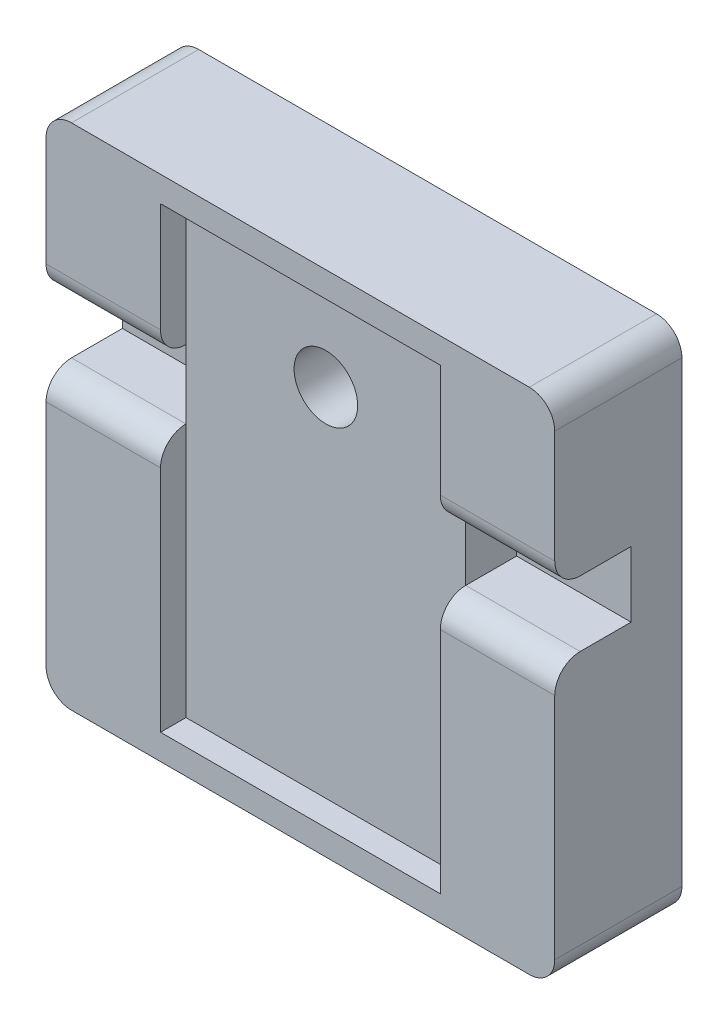
ISO-10303-21;
HEADER;
FILE_DESCRIPTION(('STEP AP214'),'2;1');
FILE_NAME('part.step','',(''),(''),'','','');
FILE_SCHEMA(('AUTOMOTIVE_DESIGN { 1 0 10303 214 1 1 1 1 }'));
ENDSEC;
DATA;
#1=APPLICATION_CONTEXT('core data for automotive mechanical design processes');
#2=APPLICATION_PROTOCOL_DEFINITION('international standard','automotive_design',2000,#1);
#3=PRODUCT_CONTEXT('',#1,'mechanical');
#4=PRODUCT('Part','Part','',(#3));
#5=PRODUCT_RELATED_PRODUCT_CATEGORY('part','',(#4));
#6=PRODUCT_DEFINITION_FORMATION('','',#4);
#7=PRODUCT_DEFINITION_CONTEXT('part definition',#1,'design');
#8=PRODUCT_DEFINITION('design','',#6,#7);
#9=PRODUCT_DEFINITION_SHAPE('','',#8);
#10=(LENGTH_UNIT() NAMED_UNIT(*) SI_UNIT(.MILLI.,.METRE.));
#11=(NAMED_UNIT(*) PLANE_ANGLE_UNIT() SI_UNIT($,.RADIAN.));
#12=(NAMED_UNIT(*) SI_UNIT($,.STERADIAN.) SOLID_ANGLE_UNIT());
#13=UNCERTAINTY_MEASURE_WITH_UNIT(LENGTH_MEASURE(1.E-05),#10,'distance_accuracy_value','');
#14=(GEOMETRIC_REPRESENTATION_CONTEXT(3) GLOBAL_UNCERTAINTY_ASSIGNED_CONTEXT((#13)) GLOBAL_UNIT_ASSIGNED_CONTEXT((#10,
#11,#12)) REPRESENTATION_CONTEXT('',''));
#15=CARTESIAN_POINT('',(0.,0.,0.));
#16=DIRECTION('',(0.,0.,1.));
#17=DIRECTION('',(1.,0.,0.));
#18=AXIS2_PLACEMENT_3D('',#15,#16,#17);
#19=CARTESIAN_POINT('',(0.,0.,5.));
#20=DIRECTION('',(0.,0.,1.));
#21=DIRECTION('',(1.,0.,0.));
#22=AXIS2_PLACEMENT_3D('',#19,#20,#21);
#23=PLANE('',#22);
#24=DIRECTION('',(0.,1.,0.));
#25=VECTOR('',#24,1.);
#26=CARTESIAN_POINT('',(5.5,9.,5.));
#27=LINE('',#26,#25);
#28=CARTESIAN_POINT('',(5.5,4.57485358255454,5.));
#29=VERTEX_POINT('',#28);
#30=CARTESIAN_POINT('',(5.5,9.,5.));
#31=VERTEX_POINT('',#30);
#32=EDGE_CURVE('E258',#29,#31,#27,.T.);
#33=ORIENTED_EDGE('',*,*,#32,.F.);
#34=DIRECTION('',(-1.,0.,0.));
#35=VECTOR('',#34,1.);
#36=CARTESIAN_POINT('',(10.,4.57485358255454,5.));
#37=LINE('',#36,#35);
#38=CARTESIAN_POINT('',(10.,4.57485358255454,5.));
#39=VERTEX_POINT('',#38);
#40=EDGE_CURVE('E356',#29,#39,#37,.F.);
#41=ORIENTED_EDGE('',*,*,#40,.T.);
#42=DIRECTION('',(0.,1.,0.));
#43=VECTOR('',#42,1.);
#44=CARTESIAN_POINT('',(10.,10.,5.));
#45=LINE('',#44,#43);
#46=CARTESIAN_POINT('',(10.,9.,5.));
#47=VERTEX_POINT('',#46);
#48=EDGE_CURVE('E303',#39,#47,#45,.T.);
#49=ORIENTED_EDGE('',*,*,#48,.T.);
#50=CARTESIAN_POINT('',(9.,9.,5.));
#51=DIRECTION('',(0.,0.,1.));
#52=DIRECTION('',(1.,0.,0.));
#53=AXIS2_PLACEMENT_3D('',#50,#51,#52);
#54=CIRCLE('',#53,1.);
#55=CARTESIAN_POINT('',(9.,10.,5.));
#56=VERTEX_POINT('',#55);
#57=EDGE_CURVE('E352',#47,#56,#54,.T.);
#58=ORIENTED_EDGE('',*,*,#57,.T.);
#59=DIRECTION('',(-1.,0.,0.));
#60=VECTOR('',#59,1.);
#61=CARTESIAN_POINT('',(-10.,10.,5.));
#62=LINE('',#61,#60);
#63=CARTESIAN_POINT('',(-9.,10.,5.));
#64=VERTEX_POINT('',#63);
#65=EDGE_CURVE('E302',#56,#64,#62,.T.);
#66=ORIENTED_EDGE('',*,*,#65,.T.);
#67=CARTESIAN_POINT('',(-9.,9.,5.));
#68=DIRECTION('',(0.,0.,1.));
#69=DIRECTION('',(1.,0.,0.));
#70=AXIS2_PLACEMENT_3D('',#67,#68,#69);
#71=CIRCLE('',#70,1.);
#72=CARTESIAN_POINT('',(-10.,9.,5.));
#73=VERTEX_POINT('',#72);
#74=EDGE_CURVE('E350',#64,#73,#71,.T.);
#75=ORIENTED_EDGE('',*,*,#74,.T.);
#76=DIRECTION('',(0.,-1.,0.));
#77=VECTOR('',#76,1.);
#78=CARTESIAN_POINT('',(-10.,10.,5.));
#79=LINE('',#78,#77);
#80=CARTESIAN_POINT('',(-10.,4.7,5.));
#81=VERTEX_POINT('',#80);
#82=EDGE_CURVE('E307',#73,#81,#79,.T.);
#83=ORIENTED_EDGE('',*,*,#82,.T.);
#84=DIRECTION('',(-1.,0.,0.));
#85=VECTOR('',#84,1.);
#86=CARTESIAN_POINT('',(-5.5,4.7,5.));
#87=LINE('',#86,#85);
#88=CARTESIAN_POINT('',(-5.5,4.7,5.));
#89=VERTEX_POINT('',#88);
#90=EDGE_CURVE('E354',#81,#89,#87,.F.);
#91=ORIENTED_EDGE('',*,*,#90,.T.);
#92=DIRECTION('',(0.,-1.,0.));
#93=VECTOR('',#92,1.);
#94=CARTESIAN_POINT('',(-5.5,9.,5.));
#95=LINE('',#94,#93);
#96=CARTESIAN_POINT('',(-5.5,9.,5.));
#97=VERTEX_POINT('',#96);
#98=EDGE_CURVE('E283',#97,#89,#95,.T.);
#99=ORIENTED_EDGE('',*,*,#98,.F.);
#100=DIRECTION('',(-1.,0.,0.));
#101=VECTOR('',#100,1.);
#102=CARTESIAN_POINT('',(-5.5,9.,5.));
#103=LINE('',#102,#101);
#104=EDGE_CURVE('E279',#31,#97,#103,.T.);
#105=ORIENTED_EDGE('',*,*,#104,.F.);
#106=EDGE_LOOP('',(#33,#41,#49,#58,#66,#75,#83,#91,#99,#105));
#107=FACE_BOUND('',#106,.T.);
#108=ADVANCED_FACE('F33',(#107),#23,.T.);
#109=CARTESIAN_POINT('',(5.5,9.,4.));
#110=DIRECTION('',(1.,0.,0.));
#111=DIRECTION('',(0.,1.,0.));
#112=AXIS2_PLACEMENT_3D('',#109,#110,#111);
#113=PLANE('',#112);
#114=DIRECTION('',(0.,1.,0.));
#115=VECTOR('',#114,1.);
#116=CARTESIAN_POINT('',(5.5,9.,4.));
#117=LINE('',#116,#115);
#118=CARTESIAN_POINT('',(5.5,3.57485358255454,4.));
#119=VERTEX_POINT('',#118);
#120=CARTESIAN_POINT('',(5.5,9.,4.));
#121=VERTEX_POINT('',#120);
#122=EDGE_CURVE('E264',#119,#121,#117,.T.);
#123=ORIENTED_EDGE('',*,*,#122,.F.);
#124=CARTESIAN_POINT('',(5.5,4.57485358255454,4.));
#125=DIRECTION('',(1.,0.,0.));
#126=DIRECTION('',(0.,1.,0.));
#127=AXIS2_PLACEMENT_3D('',#124,#125,#126);
#128=CIRCLE('',#127,1.);
#129=EDGE_CURVE('E348',#119,#29,#128,.F.);
#130=ORIENTED_EDGE('',*,*,#129,.T.);
#131=ORIENTED_EDGE('',*,*,#32,.T.);
#132=DIRECTION('',(0.,0.,1.));
#133=VECTOR('',#132,1.);
#134=CARTESIAN_POINT('',(5.5,9.,4.));
#135=LINE('',#134,#133);
#136=EDGE_CURVE('E275',#121,#31,#135,.T.);
#137=ORIENTED_EDGE('',*,*,#136,.F.);
#138=EDGE_LOOP('',(#123,#130,#131,#137));
#139=FACE_BOUND('',#138,.T.);
#140=ADVANCED_FACE('F499',(#139),#113,.F.);
#141=CARTESIAN_POINT('',(-5.5,9.,4.));
#142=DIRECTION('',(-1.,0.,0.));
#143=DIRECTION('',(0.,-1.,0.));
#144=AXIS2_PLACEMENT_3D('',#141,#142,#143);
#145=PLANE('',#144);
#146=ORIENTED_EDGE('',*,*,#98,.T.);
#147=CARTESIAN_POINT('',(-5.5,4.7,4.));
#148=DIRECTION('',(-1.,0.,0.));
#149=DIRECTION('',(0.,-1.,0.));
#150=AXIS2_PLACEMENT_3D('',#147,#148,#149);
#151=CIRCLE('',#150,1.);
#152=CARTESIAN_POINT('',(-5.5,3.7,4.));
#153=VERTEX_POINT('',#152);
#154=EDGE_CURVE('E373',#89,#153,#151,.F.);
#155=ORIENTED_EDGE('',*,*,#154,.T.);
#156=DIRECTION('',(0.,-1.,0.));
#157=VECTOR('',#156,1.);
#158=CARTESIAN_POINT('',(-5.5,9.,4.));
#159=LINE('',#158,#157);
#160=CARTESIAN_POINT('',(-5.5,9.,4.));
#161=VERTEX_POINT('',#160);
#162=EDGE_CURVE('E268',#161,#153,#159,.T.);
#163=ORIENTED_EDGE('',*,*,#162,.F.);
#164=DIRECTION('',(0.,0.,1.));
#165=VECTOR('',#164,1.);
#166=CARTESIAN_POINT('',(-5.5,9.,4.));
#167=LINE('',#166,#165);
#168=EDGE_CURVE('E295',#161,#97,#167,.T.);
#169=ORIENTED_EDGE('',*,*,#168,.T.);
#170=EDGE_LOOP('',(#146,#155,#163,#169));
#171=FACE_BOUND('',#170,.T.);
#172=ADVANCED_FACE('F470',(#171),#145,.F.);
#173=CARTESIAN_POINT('',(10.,10.,5.));
#174=DIRECTION('',(-1.,0.,0.));
#175=DIRECTION('',(0.,-1.,0.));
#176=AXIS2_PLACEMENT_3D('',#173,#174,#175);
#177=PLANE('',#176);
#178=DIRECTION('',(0.,0.,1.));
#179=VECTOR('',#178,1.);
#180=CARTESIAN_POINT('',(10.,1.,2.));
#181=LINE('',#180,#179);
#182=CARTESIAN_POINT('',(10.,1.,2.));
#183=VERTEX_POINT('',#182);
#184=CARTESIAN_POINT('',(10.,1.,4.));
#185=VERTEX_POINT('',#184);
#186=EDGE_CURVE('E246',#183,#185,#181,.T.);
#187=ORIENTED_EDGE('',*,*,#186,.T.);
#188=CARTESIAN_POINT('',(10.,0.,4.));
#189=DIRECTION('',(-1.,0.,0.));
#190=DIRECTION('',(0.,-1.,0.));
#191=AXIS2_PLACEMENT_3D('',#188,#189,#190);
#192=CIRCLE('',#191,1.);
#193=CARTESIAN_POINT('',(10.,0.,5.));
#194=VERTEX_POINT('',#193);
#195=EDGE_CURVE('E333',#185,#194,#192,.F.);
#196=ORIENTED_EDGE('',*,*,#195,.T.);
#197=CARTESIAN_POINT('',(10.,-9.,5.));
#198=VERTEX_POINT('',#197);
#199=EDGE_CURVE('E299',#198,#194,#45,.T.);
#200=ORIENTED_EDGE('',*,*,#199,.F.);
#201=DIRECTION('',(0.,0.,-1.));
#202=VECTOR('',#201,1.);
#203=CARTESIAN_POINT('',(10.,-9.,5.));
#204=LINE('',#203,#202);
#205=CARTESIAN_POINT('',(10.,-9.,0.));
#206=VERTEX_POINT('',#205);
#207=EDGE_CURVE('E328',#198,#206,#204,.T.);
#208=ORIENTED_EDGE('',*,*,#207,.T.);
#209=DIRECTION('',(0.,1.,0.));
#210=VECTOR('',#209,1.);
#211=CARTESIAN_POINT('',(10.,10.,0.));
#212=LINE('',#211,#210);
#213=CARTESIAN_POINT('',(10.,9.,0.));
#214=VERTEX_POINT('',#213);
#215=EDGE_CURVE('E291',#206,#214,#212,.T.);
#216=ORIENTED_EDGE('',*,*,#215,.T.);
#217=DIRECTION('',(0.,0.,-1.));
#218=VECTOR('',#217,1.);
#219=CARTESIAN_POINT('',(10.,9.,5.));
#220=LINE('',#219,#218);
#221=EDGE_CURVE('E326',#214,#47,#220,.F.);
#222=ORIENTED_EDGE('',*,*,#221,.T.);
#223=ORIENTED_EDGE('',*,*,#48,.F.);
#224=CARTESIAN_POINT('',(10.,4.57485358255454,4.));
#225=DIRECTION('',(-1.,0.,0.));
#226=DIRECTION('',(0.,-1.,0.));
#227=AXIS2_PLACEMENT_3D('',#224,#225,#226);
#228=CIRCLE('',#227,1.);
#229=CARTESIAN_POINT('',(10.,3.57485358255454,4.));
#230=VERTEX_POINT('',#229);
#231=EDGE_CURVE('E331',#39,#230,#228,.F.);
#232=ORIENTED_EDGE('',*,*,#231,.T.);
#233=DIRECTION('',(0.,0.,1.));
#234=VECTOR('',#233,1.);
#235=CARTESIAN_POINT('',(10.,3.57485358255454,2.));
#236=LINE('',#235,#234);
#237=CARTESIAN_POINT('',(10.,3.57485358255454,2.));
#238=VERTEX_POINT('',#237);
#239=EDGE_CURVE('E243',#238,#230,#236,.T.);
#240=ORIENTED_EDGE('',*,*,#239,.F.);
#241=DIRECTION('',(0.,1.,0.));
#242=VECTOR('',#241,1.);
#243=CARTESIAN_POINT('',(10.,1.,2.));
#244=LINE('',#243,#242);
#245=EDGE_CURVE('E235',#183,#238,#244,.T.);
#246=ORIENTED_EDGE('',*,*,#245,.F.);
#247=EDGE_LOOP('',(#187,#196,#200,#208,#216,#222,#223,#232,#240,#246));
#248=FACE_BOUND('',#247,.T.);
#249=ADVANCED_FACE('F418',(#248),#177,.F.);
#250=CARTESIAN_POINT('',(-10.,10.,5.));
#251=DIRECTION('',(0.,-1.,0.));
#252=DIRECTION('',(0.,0.,-1.));
#253=AXIS2_PLACEMENT_3D('',#250,#251,#252);
#254=PLANE('',#253);
#255=ORIENTED_EDGE('',*,*,#65,.F.);
#256=DIRECTION('',(0.,0.,-1.));
#257=VECTOR('',#256,1.);
#258=CARTESIAN_POINT('',(9.,10.,5.));
#259=LINE('',#258,#257);
#260=CARTESIAN_POINT('',(9.,10.,0.));
#261=VERTEX_POINT('',#260);
#262=EDGE_CURVE('E11',#56,#261,#259,.T.);
#263=ORIENTED_EDGE('',*,*,#262,.T.);
#264=DIRECTION('',(-1.,0.,0.));
#265=VECTOR('',#264,1.);
#266=CARTESIAN_POINT('',(-10.,10.,0.));
#267=LINE('',#266,#265);
#268=CARTESIAN_POINT('',(-9.,10.,0.));
#269=VERTEX_POINT('',#268);
#270=EDGE_CURVE('E316',#261,#269,#267,.T.);
#271=ORIENTED_EDGE('',*,*,#270,.T.);
#272=DIRECTION('',(0.,0.,-1.));
#273=VECTOR('',#272,1.);
#274=CARTESIAN_POINT('',(-9.,10.,5.));
#275=LINE('',#274,#273);
#276=EDGE_CURVE('E41',#269,#64,#275,.F.);
#277=ORIENTED_EDGE('',*,*,#276,.T.);
#278=EDGE_LOOP('',(#255,#263,#271,#277));
#279=FACE_BOUND('',#278,.T.);
#280=ADVANCED_FACE('F388',(#279),#254,.F.);
#281=CARTESIAN_POINT('',(-10.,10.,5.));
#282=DIRECTION('',(1.,0.,0.));
#283=DIRECTION('',(0.,1.,0.));
#284=AXIS2_PLACEMENT_3D('',#281,#282,#283);
#285=PLANE('',#284);
#286=CARTESIAN_POINT('',(-10.,0.,5.));
#287=VERTEX_POINT('',#286);
#288=CARTESIAN_POINT('',(-10.,-9.,5.));
#289=VERTEX_POINT('',#288);
#290=EDGE_CURVE('E306',#287,#289,#79,.T.);
#291=ORIENTED_EDGE('',*,*,#290,.F.);
#292=CARTESIAN_POINT('',(-10.,0.,4.));
#293=DIRECTION('',(1.,0.,0.));
#294=DIRECTION('',(0.,1.,0.));
#295=AXIS2_PLACEMENT_3D('',#292,#293,#294);
#296=CIRCLE('',#295,1.);
#297=CARTESIAN_POINT('',(-10.,1.,4.));
#298=VERTEX_POINT('',#297);
#299=EDGE_CURVE('E222',#287,#298,#296,.F.);
#300=ORIENTED_EDGE('',*,*,#299,.T.);
#301=DIRECTION('',(0.,0.,1.));
#302=VECTOR('',#301,1.);
#303=CARTESIAN_POINT('',(-10.,1.,2.));
#304=LINE('',#303,#302);
#305=CARTESIAN_POINT('',(-10.,1.,2.));
#306=VERTEX_POINT('',#305);
#307=EDGE_CURVE('E200',#306,#298,#304,.T.);
#308=ORIENTED_EDGE('',*,*,#307,.F.);
#309=DIRECTION('',(0.,-1.,0.));
#310=VECTOR('',#309,1.);
#311=CARTESIAN_POINT('',(-10.,3.7,2.));
#312=LINE('',#311,#310);
#313=CARTESIAN_POINT('',(-10.,3.7,2.));
#314=VERTEX_POINT('',#313);
#315=EDGE_CURVE('E208',#314,#306,#312,.T.);
#316=ORIENTED_EDGE('',*,*,#315,.F.);
#317=DIRECTION('',(0.,0.,1.));
#318=VECTOR('',#317,1.);
#319=CARTESIAN_POINT('',(-10.,3.7,2.));
#320=LINE('',#319,#318);
#321=CARTESIAN_POINT('',(-10.,3.7,4.));
#322=VERTEX_POINT('',#321);
#323=EDGE_CURVE('E255',#314,#322,#320,.T.);
#324=ORIENTED_EDGE('',*,*,#323,.T.);
#325=CARTESIAN_POINT('',(-10.,4.7,4.));
#326=DIRECTION('',(1.,0.,0.));
#327=DIRECTION('',(0.,1.,0.));
#328=AXIS2_PLACEMENT_3D('',#325,#326,#327);
#329=CIRCLE('',#328,1.);
#330=EDGE_CURVE('E367',#322,#81,#329,.F.);
#331=ORIENTED_EDGE('',*,*,#330,.T.);
#332=ORIENTED_EDGE('',*,*,#82,.F.);
#333=DIRECTION('',(0.,0.,-1.));
#334=VECTOR('',#333,1.);
#335=CARTESIAN_POINT('',(-10.,9.,5.));
#336=LINE('',#335,#334);
#337=CARTESIAN_POINT('',(-10.,9.,0.));
#338=VERTEX_POINT('',#337);
#339=EDGE_CURVE('E362',#73,#338,#336,.T.);
#340=ORIENTED_EDGE('',*,*,#339,.T.);
#341=DIRECTION('',(0.,-1.,0.));
#342=VECTOR('',#341,1.);
#343=CARTESIAN_POINT('',(-10.,10.,0.));
#344=LINE('',#343,#342);
#345=CARTESIAN_POINT('',(-10.,-9.,0.));
#346=VERTEX_POINT('',#345);
#347=EDGE_CURVE('E318',#338,#346,#344,.T.);
#348=ORIENTED_EDGE('',*,*,#347,.T.);
#349=DIRECTION('',(0.,0.,-1.));
#350=VECTOR('',#349,1.);
#351=CARTESIAN_POINT('',(-10.,-9.,5.));
#352=LINE('',#351,#350);
#353=EDGE_CURVE('E365',#346,#289,#352,.F.);
#354=ORIENTED_EDGE('',*,*,#353,.T.);
#355=EDGE_LOOP('',(#291,#300,#308,#316,#324,#331,#332,#340,#348,#354));
#356=FACE_BOUND('',#355,.T.);
#357=ADVANCED_FACE('F220',(#356),#285,.F.);
#358=CARTESIAN_POINT('',(-10.,-10.,5.));
#359=DIRECTION('',(0.,1.,0.));
#360=DIRECTION('',(0.,0.,1.));
#361=AXIS2_PLACEMENT_3D('',#358,#359,#360);
#362=PLANE('',#361);
#363=DIRECTION('',(1.,0.,0.));
#364=VECTOR('',#363,1.);
#365=CARTESIAN_POINT('',(-10.,-10.,5.));
#366=LINE('',#365,#364);
#367=CARTESIAN_POINT('',(-9.,-10.,5.));
#368=VERTEX_POINT('',#367);
#369=CARTESIAN_POINT('',(9.,-10.,5.));
#370=VERTEX_POINT('',#369);
#371=EDGE_CURVE('E310',#368,#370,#366,.T.);
#372=ORIENTED_EDGE('',*,*,#371,.F.);
#373=DIRECTION('',(0.,0.,-1.));
#374=VECTOR('',#373,1.);
#375=CARTESIAN_POINT('',(-9.,-10.,5.));
#376=LINE('',#375,#374);
#377=CARTESIAN_POINT('',(-9.,-10.,0.));
#378=VERTEX_POINT('',#377);
#379=EDGE_CURVE('E377',#368,#378,#376,.T.);
#380=ORIENTED_EDGE('',*,*,#379,.T.);
#381=DIRECTION('',(1.,0.,0.));
#382=VECTOR('',#381,1.);
#383=CARTESIAN_POINT('',(-10.,-10.,0.));
#384=LINE('',#383,#382);
#385=CARTESIAN_POINT('',(9.,-10.,0.));
#386=VERTEX_POINT('',#385);
#387=EDGE_CURVE('E321',#378,#386,#384,.T.);
#388=ORIENTED_EDGE('',*,*,#387,.T.);
#389=DIRECTION('',(0.,0.,-1.));
#390=VECTOR('',#389,1.);
#391=CARTESIAN_POINT('',(9.,-10.,5.));
#392=LINE('',#391,#390);
#393=EDGE_CURVE('E375',#386,#370,#392,.F.);
#394=ORIENTED_EDGE('',*,*,#393,.T.);
#395=EDGE_LOOP('',(#372,#380,#388,#394));
#396=FACE_BOUND('',#395,.T.);
#397=ADVANCED_FACE('F406',(#396),#362,.F.);
#398=ORIENTED_EDGE('',*,*,#199,.T.);
#399=DIRECTION('',(1.,0.,0.));
#400=VECTOR('',#399,1.);
#401=CARTESIAN_POINT('',(5.5,0.,5.));
#402=LINE('',#401,#400);
#403=CARTESIAN_POINT('',(5.5,0.,5.));
#404=VERTEX_POINT('',#403);
#405=EDGE_CURVE('E341',#194,#404,#402,.F.);
#406=ORIENTED_EDGE('',*,*,#405,.T.);
#407=CARTESIAN_POINT('',(5.5,-9.,5.));
#408=VERTEX_POINT('',#407);
#409=EDGE_CURVE('E276',#408,#404,#27,.T.);
#410=ORIENTED_EDGE('',*,*,#409,.F.);
#411=DIRECTION('',(1.,0.,0.));
#412=VECTOR('',#411,1.);
#413=CARTESIAN_POINT('',(-5.5,-9.,5.));
#414=LINE('',#413,#412);
#415=CARTESIAN_POINT('',(-5.5,-9.,5.));
#416=VERTEX_POINT('',#415);
#417=EDGE_CURVE('E286',#416,#408,#414,.T.);
#418=ORIENTED_EDGE('',*,*,#417,.F.);
#419=CARTESIAN_POINT('',(-5.5,0.,5.));
#420=VERTEX_POINT('',#419);
#421=EDGE_CURVE('E282',#420,#416,#95,.T.);
#422=ORIENTED_EDGE('',*,*,#421,.F.);
#423=DIRECTION('',(1.,0.,0.));
#424=VECTOR('',#423,1.);
#425=CARTESIAN_POINT('',(-10.,0.,5.));
#426=LINE('',#425,#424);
#427=EDGE_CURVE('E339',#420,#287,#426,.F.);
#428=ORIENTED_EDGE('',*,*,#427,.T.);
#429=ORIENTED_EDGE('',*,*,#290,.T.);
#430=CARTESIAN_POINT('',(-9.,-9.,5.));
#431=DIRECTION('',(0.,0.,1.));
#432=DIRECTION('',(1.,0.,0.));
#433=AXIS2_PLACEMENT_3D('',#430,#431,#432);
#434=CIRCLE('',#433,1.);
#435=EDGE_CURVE('E337',#289,#368,#434,.T.);
#436=ORIENTED_EDGE('',*,*,#435,.T.);
#437=ORIENTED_EDGE('',*,*,#371,.T.);
#438=CARTESIAN_POINT('',(9.,-9.,5.));
#439=DIRECTION('',(0.,0.,1.));
#440=DIRECTION('',(1.,0.,0.));
#441=AXIS2_PLACEMENT_3D('',#438,#439,#440);
#442=CIRCLE('',#441,1.);
#443=EDGE_CURVE('E335',#370,#198,#442,.T.);
#444=ORIENTED_EDGE('',*,*,#443,.T.);
#445=EDGE_LOOP('',(#398,#406,#410,#418,#422,#428,#429,#436,#437,#444));
#446=FACE_BOUND('',#445,.T.);
#447=ADVANCED_FACE('F410',(#446),#23,.T.);
#448=CARTESIAN_POINT('',(0.,0.,0.));
#449=DIRECTION('',(0.,0.,1.));
#450=DIRECTION('',(1.,0.,0.));
#451=AXIS2_PLACEMENT_3D('',#448,#449,#450);
#452=PLANE('',#451);
#453=CARTESIAN_POINT('',(0.,5.,0.));
#454=DIRECTION('',(0.,0.,1.));
#455=DIRECTION('',(1.,0.,0.));
#456=AXIS2_PLACEMENT_3D('',#453,#454,#455);
#457=CIRCLE('',#456,1.25);
#458=CARTESIAN_POINT('',(1.25,5.,0.));
#459=VERTEX_POINT('',#458);
#460=EDGE_CURVE('E251',#459,#459,#457,.T.);
#461=ORIENTED_EDGE('',*,*,#460,.T.);
#462=EDGE_LOOP('',(#461));
#463=FACE_BOUND('',#462,.T.);
#464=ORIENTED_EDGE('',*,*,#387,.F.);
#465=CARTESIAN_POINT('',(-9.,-9.,0.));
#466=DIRECTION('',(0.,0.,1.));
#467=DIRECTION('',(1.,0.,0.));
#468=AXIS2_PLACEMENT_3D('',#465,#466,#467);
#469=CIRCLE('',#468,1.);
#470=EDGE_CURVE('E384',#378,#346,#469,.F.);
#471=ORIENTED_EDGE('',*,*,#470,.T.);
#472=ORIENTED_EDGE('',*,*,#347,.F.);
#473=CARTESIAN_POINT('',(-9.,9.,0.));
#474=DIRECTION('',(0.,0.,1.));
#475=DIRECTION('',(1.,0.,0.));
#476=AXIS2_PLACEMENT_3D('',#473,#474,#475);
#477=CIRCLE('',#476,1.);
#478=EDGE_CURVE('E48',#338,#269,#477,.F.);
#479=ORIENTED_EDGE('',*,*,#478,.T.);
#480=ORIENTED_EDGE('',*,*,#270,.F.);
#481=CARTESIAN_POINT('',(9.,9.,0.));
#482=DIRECTION('',(0.,0.,1.));
#483=DIRECTION('',(1.,0.,0.));
#484=AXIS2_PLACEMENT_3D('',#481,#482,#483);
#485=CIRCLE('',#484,1.);
#486=EDGE_CURVE('E56',#261,#214,#485,.F.);
#487=ORIENTED_EDGE('',*,*,#486,.T.);
#488=ORIENTED_EDGE('',*,*,#215,.F.);
#489=CARTESIAN_POINT('',(9.,-9.,0.));
#490=DIRECTION('',(0.,0.,1.));
#491=DIRECTION('',(1.,0.,0.));
#492=AXIS2_PLACEMENT_3D('',#489,#490,#491);
#493=CIRCLE('',#492,1.);
#494=EDGE_CURVE('E382',#206,#386,#493,.F.);
#495=ORIENTED_EDGE('',*,*,#494,.T.);
#496=EDGE_LOOP('',(#464,#471,#472,#479,#480,#487,#488,#495));
#497=FACE_BOUND('',#496,.T.);
#498=ADVANCED_FACE('F399',(#463,#497),#452,.F.);
#499=ORIENTED_EDGE('',*,*,#409,.T.);
#500=CARTESIAN_POINT('',(5.5,0.,4.));
#501=DIRECTION('',(1.,0.,0.));
#502=DIRECTION('',(0.,1.,0.));
#503=AXIS2_PLACEMENT_3D('',#500,#501,#502);
#504=CIRCLE('',#503,1.);
#505=CARTESIAN_POINT('',(5.5,1.,4.));
#506=VERTEX_POINT('',#505);
#507=EDGE_CURVE('E343',#404,#506,#504,.F.);
#508=ORIENTED_EDGE('',*,*,#507,.T.);
#509=CARTESIAN_POINT('',(5.5,-9.,4.));
#510=VERTEX_POINT('',#509);
#511=EDGE_CURVE('E259',#510,#506,#117,.T.);
#512=ORIENTED_EDGE('',*,*,#511,.F.);
#513=DIRECTION('',(0.,0.,1.));
#514=VECTOR('',#513,1.);
#515=CARTESIAN_POINT('',(5.5,-9.,4.));
#516=LINE('',#515,#514);
#517=EDGE_CURVE('E289',#510,#408,#516,.T.);
#518=ORIENTED_EDGE('',*,*,#517,.T.);
#519=EDGE_LOOP('',(#499,#508,#512,#518));
#520=FACE_BOUND('',#519,.T.);
#521=ADVANCED_FACE('F428',(#520),#113,.F.);
#522=CARTESIAN_POINT('',(-5.5,-9.,4.));
#523=DIRECTION('',(0.,-1.,0.));
#524=DIRECTION('',(0.,0.,-1.));
#525=AXIS2_PLACEMENT_3D('',#522,#523,#524);
#526=PLANE('',#525);
#527=ORIENTED_EDGE('',*,*,#417,.T.);
#528=ORIENTED_EDGE('',*,*,#517,.F.);
#529=DIRECTION('',(1.,0.,0.));
#530=VECTOR('',#529,1.);
#531=CARTESIAN_POINT('',(-5.5,-9.,4.));
#532=LINE('',#531,#530);
#533=CARTESIAN_POINT('',(-5.5,-9.,4.));
#534=VERTEX_POINT('',#533);
#535=EDGE_CURVE('E271',#534,#510,#532,.T.);
#536=ORIENTED_EDGE('',*,*,#535,.F.);
#537=DIRECTION('',(0.,0.,1.));
#538=VECTOR('',#537,1.);
#539=CARTESIAN_POINT('',(-5.5,-9.,4.));
#540=LINE('',#539,#538);
#541=EDGE_CURVE('E292',#534,#416,#540,.T.);
#542=ORIENTED_EDGE('',*,*,#541,.T.);
#543=EDGE_LOOP('',(#527,#528,#536,#542));
#544=FACE_BOUND('',#543,.T.);
#545=ADVANCED_FACE('F444',(#544),#526,.F.);
#546=CARTESIAN_POINT('',(-5.5,1.,4.));
#547=VERTEX_POINT('',#546);
#548=EDGE_CURVE('E267',#547,#534,#159,.T.);
#549=ORIENTED_EDGE('',*,*,#548,.F.);
#550=CARTESIAN_POINT('',(-5.5,0.,4.));
#551=DIRECTION('',(-1.,0.,0.));
#552=DIRECTION('',(0.,-1.,0.));
#553=AXIS2_PLACEMENT_3D('',#550,#551,#552);
#554=CIRCLE('',#553,1.);
#555=EDGE_CURVE('E360',#547,#420,#554,.F.);
#556=ORIENTED_EDGE('',*,*,#555,.T.);
#557=ORIENTED_EDGE('',*,*,#421,.T.);
#558=ORIENTED_EDGE('',*,*,#541,.F.);
#559=EDGE_LOOP('',(#549,#556,#557,#558));
#560=FACE_BOUND('',#559,.T.);
#561=ADVANCED_FACE('F455',(#560),#145,.F.);
#562=CARTESIAN_POINT('',(-5.5,9.,4.));
#563=DIRECTION('',(0.,1.,0.));
#564=DIRECTION('',(0.,0.,1.));
#565=AXIS2_PLACEMENT_3D('',#562,#563,#564);
#566=PLANE('',#565);
#567=ORIENTED_EDGE('',*,*,#104,.T.);
#568=ORIENTED_EDGE('',*,*,#168,.F.);
#569=DIRECTION('',(-1.,0.,0.));
#570=VECTOR('',#569,1.);
#571=CARTESIAN_POINT('',(-5.5,9.,4.));
#572=LINE('',#571,#570);
#573=EDGE_CURVE('E262',#121,#161,#572,.T.);
#574=ORIENTED_EDGE('',*,*,#573,.F.);
#575=ORIENTED_EDGE('',*,*,#136,.T.);
#576=EDGE_LOOP('',(#567,#568,#574,#575));
#577=FACE_BOUND('',#576,.T.);
#578=ADVANCED_FACE('F472',(#577),#566,.F.);
#579=CARTESIAN_POINT('',(0.,0.,4.));
#580=DIRECTION('',(0.,0.,1.));
#581=DIRECTION('',(1.,0.,0.));
#582=AXIS2_PLACEMENT_3D('',#579,#580,#581);
#583=PLANE('',#582);
#584=CARTESIAN_POINT('',(0.,5.,4.));
#585=DIRECTION('',(0.,0.,1.));
#586=DIRECTION('',(1.,0.,0.));
#587=AXIS2_PLACEMENT_3D('',#584,#585,#586);
#588=CIRCLE('',#587,1.25);
#589=CARTESIAN_POINT('',(1.25,5.,4.));
#590=VERTEX_POINT('',#589);
#591=EDGE_CURVE('E254',#590,#590,#588,.T.);
#592=ORIENTED_EDGE('',*,*,#591,.F.);
#593=EDGE_LOOP('',(#592));
#594=FACE_BOUND('',#593,.T.);
#595=ORIENTED_EDGE('',*,*,#511,.T.);
#596=EDGE_CURVE('E263',#506,#119,#117,.T.);
#597=ORIENTED_EDGE('',*,*,#596,.T.);
#598=ORIENTED_EDGE('',*,*,#122,.T.);
#599=ORIENTED_EDGE('',*,*,#573,.T.);
#600=ORIENTED_EDGE('',*,*,#162,.T.);
#601=EDGE_CURVE('E272',#153,#547,#159,.T.);
#602=ORIENTED_EDGE('',*,*,#601,.T.);
#603=ORIENTED_EDGE('',*,*,#548,.T.);
#604=ORIENTED_EDGE('',*,*,#535,.T.);
#605=EDGE_LOOP('',(#595,#597,#598,#599,#600,#602,#603,#604));
#606=FACE_BOUND('',#605,.T.);
#607=ADVANCED_FACE('F438',(#594,#606),#583,.T.);
#608=CARTESIAN_POINT('',(0.,5.,0.));
#609=DIRECTION('',(0.,0.,1.));
#610=DIRECTION('',(1.,0.,0.));
#611=AXIS2_PLACEMENT_3D('',#608,#609,#610);
#612=CYLINDRICAL_SURFACE('',#611,1.25);
#613=ORIENTED_EDGE('',*,*,#591,.T.);
#614=EDGE_LOOP('',(#613));
#615=FACE_BOUND('',#614,.T.);
#616=ORIENTED_EDGE('',*,*,#460,.F.);
#617=EDGE_LOOP('',(#616));
#618=FACE_BOUND('',#617,.T.);
#619=ADVANCED_FACE('F626',(#615,#618),#612,.F.);
#620=CARTESIAN_POINT('',(5.5,1.,2.));
#621=DIRECTION('',(-1.,0.,0.));
#622=DIRECTION('',(0.,0.,1.));
#623=AXIS2_PLACEMENT_3D('',#620,#621,#622);
#624=PLANE('',#623);
#625=ORIENTED_EDGE('',*,*,#596,.F.);
#626=DIRECTION('',(0.,0.,1.));
#627=VECTOR('',#626,1.);
#628=CARTESIAN_POINT('',(5.5,1.,2.));
#629=LINE('',#628,#627);
#630=CARTESIAN_POINT('',(5.5,1.,2.));
#631=VERTEX_POINT('',#630);
#632=EDGE_CURVE('E240',#631,#506,#629,.T.);
#633=ORIENTED_EDGE('',*,*,#632,.F.);
#634=DIRECTION('',(0.,-1.,0.));
#635=VECTOR('',#634,1.);
#636=CARTESIAN_POINT('',(5.5,1.,2.));
#637=LINE('',#636,#635);
#638=CARTESIAN_POINT('',(5.5,3.57485358255454,2.));
#639=VERTEX_POINT('',#638);
#640=EDGE_CURVE('E229',#639,#631,#637,.T.);
#641=ORIENTED_EDGE('',*,*,#640,.F.);
#642=DIRECTION('',(0.,0.,1.));
#643=VECTOR('',#642,1.);
#644=CARTESIAN_POINT('',(5.5,3.57485358255454,2.));
#645=LINE('',#644,#643);
#646=EDGE_CURVE('E217',#639,#119,#645,.T.);
#647=ORIENTED_EDGE('',*,*,#646,.T.);
#648=EDGE_LOOP('',(#625,#633,#641,#647));
#649=FACE_BOUND('',#648,.T.);
#650=ADVANCED_FACE('F431',(#649),#624,.F.);
#651=CARTESIAN_POINT('',(5.5,3.57485358255454,2.));
#652=DIRECTION('',(0.,1.,0.));
#653=DIRECTION('',(0.,0.,1.));
#654=AXIS2_PLACEMENT_3D('',#651,#652,#653);
#655=PLANE('',#654);
#656=ORIENTED_EDGE('',*,*,#239,.T.);
#657=DIRECTION('',(-1.,0.,0.));
#658=VECTOR('',#657,1.);
#659=CARTESIAN_POINT('',(5.5,3.57485358255454,4.));
#660=LINE('',#659,#658);
#661=EDGE_CURVE('E345',#230,#119,#660,.T.);
#662=ORIENTED_EDGE('',*,*,#661,.T.);
#663=ORIENTED_EDGE('',*,*,#646,.F.);
#664=DIRECTION('',(-1.,0.,0.));
#665=VECTOR('',#664,1.);
#666=CARTESIAN_POINT('',(5.5,3.57485358255454,2.));
#667=LINE('',#666,#665);
#668=EDGE_CURVE('E237',#238,#639,#667,.T.);
#669=ORIENTED_EDGE('',*,*,#668,.F.);
#670=EDGE_LOOP('',(#656,#662,#663,#669));
#671=FACE_BOUND('',#670,.T.);
#672=ADVANCED_FACE('F485',(#671),#655,.F.);
#673=CARTESIAN_POINT('',(5.5,1.,2.));
#674=DIRECTION('',(0.,-1.,0.));
#675=DIRECTION('',(0.,0.,-1.));
#676=AXIS2_PLACEMENT_3D('',#673,#674,#675);
#677=PLANE('',#676);
#678=ORIENTED_EDGE('',*,*,#632,.T.);
#679=DIRECTION('',(1.,0.,0.));
#680=VECTOR('',#679,1.);
#681=CARTESIAN_POINT('',(10.,1.,4.));
#682=LINE('',#681,#680);
#683=EDGE_CURVE('E313',#506,#185,#682,.T.);
#684=ORIENTED_EDGE('',*,*,#683,.T.);
#685=ORIENTED_EDGE('',*,*,#186,.F.);
#686=DIRECTION('',(1.,0.,0.));
#687=VECTOR('',#686,1.);
#688=CARTESIAN_POINT('',(5.5,1.,2.));
#689=LINE('',#688,#687);
#690=EDGE_CURVE('E232',#631,#183,#689,.T.);
#691=ORIENTED_EDGE('',*,*,#690,.F.);
#692=EDGE_LOOP('',(#678,#684,#685,#691));
#693=FACE_BOUND('',#692,.T.);
#694=ADVANCED_FACE('F437',(#693),#677,.F.);
#695=CARTESIAN_POINT('',(0.,0.,2.));
#696=DIRECTION('',(0.,0.,-1.));
#697=DIRECTION('',(-1.,0.,0.));
#698=AXIS2_PLACEMENT_3D('',#695,#696,#697);
#699=PLANE('',#698);
#700=ORIENTED_EDGE('',*,*,#640,.T.);
#701=ORIENTED_EDGE('',*,*,#690,.T.);
#702=ORIENTED_EDGE('',*,*,#245,.T.);
#703=ORIENTED_EDGE('',*,*,#668,.T.);
#704=EDGE_LOOP('',(#700,#701,#702,#703));
#705=FACE_BOUND('',#704,.T.);
#706=ADVANCED_FACE('F487',(#705),#699,.F.);
#707=CARTESIAN_POINT('',(-10.,3.7,2.));
#708=DIRECTION('',(0.,1.,0.));
#709=DIRECTION('',(0.,0.,1.));
#710=AXIS2_PLACEMENT_3D('',#707,#708,#709);
#711=PLANE('',#710);
#712=DIRECTION('',(0.,0.,1.));
#713=VECTOR('',#712,1.);
#714=CARTESIAN_POINT('',(-5.5,3.7,2.));
#715=LINE('',#714,#713);
#716=CARTESIAN_POINT('',(-5.5,3.7,2.));
#717=VERTEX_POINT('',#716);
#718=EDGE_CURVE('E224',#717,#153,#715,.T.);
#719=ORIENTED_EDGE('',*,*,#718,.T.);
#720=DIRECTION('',(-1.,0.,0.));
#721=VECTOR('',#720,1.);
#722=CARTESIAN_POINT('',(-10.,3.7,4.));
#723=LINE('',#722,#721);
#724=EDGE_CURVE('E370',#153,#322,#723,.T.);
#725=ORIENTED_EDGE('',*,*,#724,.T.);
#726=ORIENTED_EDGE('',*,*,#323,.F.);
#727=DIRECTION('',(-1.,0.,0.));
#728=VECTOR('',#727,1.);
#729=CARTESIAN_POINT('',(-10.,3.7,2.));
#730=LINE('',#729,#728);
#731=EDGE_CURVE('E214',#717,#314,#730,.T.);
#732=ORIENTED_EDGE('',*,*,#731,.F.);
#733=EDGE_LOOP('',(#719,#725,#726,#732));
#734=FACE_BOUND('',#733,.T.);
#735=ADVANCED_FACE('F465',(#734),#711,.F.);
#736=CARTESIAN_POINT('',(-5.5,3.7,2.));
#737=DIRECTION('',(1.,0.,0.));
#738=DIRECTION('',(0.,0.,-1.));
#739=AXIS2_PLACEMENT_3D('',#736,#737,#738);
#740=PLANE('',#739);
#741=ORIENTED_EDGE('',*,*,#601,.F.);
#742=ORIENTED_EDGE('',*,*,#718,.F.);
#743=DIRECTION('',(0.,1.,0.));
#744=VECTOR('',#743,1.);
#745=CARTESIAN_POINT('',(-5.5,3.7,2.));
#746=LINE('',#745,#744);
#747=CARTESIAN_POINT('',(-5.5,1.,2.));
#748=VERTEX_POINT('',#747);
#749=EDGE_CURVE('E207',#748,#717,#746,.T.);
#750=ORIENTED_EDGE('',*,*,#749,.F.);
#751=DIRECTION('',(0.,0.,1.));
#752=VECTOR('',#751,1.);
#753=CARTESIAN_POINT('',(-5.5,1.,2.));
#754=LINE('',#753,#752);
#755=EDGE_CURVE('E203',#748,#547,#754,.T.);
#756=ORIENTED_EDGE('',*,*,#755,.T.);
#757=EDGE_LOOP('',(#741,#742,#750,#756));
#758=FACE_BOUND('',#757,.T.);
#759=ADVANCED_FACE('F453',(#758),#740,.F.);
#760=CARTESIAN_POINT('',(-10.,1.,2.));
#761=DIRECTION('',(0.,-1.,0.));
#762=DIRECTION('',(1.,0.,0.));
#763=AXIS2_PLACEMENT_3D('',#760,#761,#762);
#764=PLANE('',#763);
#765=ORIENTED_EDGE('',*,*,#307,.T.);
#766=DIRECTION('',(1.,0.,0.));
#767=VECTOR('',#766,1.);
#768=CARTESIAN_POINT('',(-5.5,1.,4.));
#769=LINE('',#768,#767);
#770=EDGE_CURVE('E358',#298,#547,#769,.T.);
#771=ORIENTED_EDGE('',*,*,#770,.T.);
#772=ORIENTED_EDGE('',*,*,#755,.F.);
#773=DIRECTION('',(1.,0.,0.));
#774=VECTOR('',#773,1.);
#775=CARTESIAN_POINT('',(-10.,1.,2.));
#776=LINE('',#775,#774);
#777=EDGE_CURVE('E195',#306,#748,#776,.T.);
#778=ORIENTED_EDGE('',*,*,#777,.F.);
#779=EDGE_LOOP('',(#765,#771,#772,#778));
#780=FACE_BOUND('',#779,.T.);
#781=ADVANCED_FACE('F197',(#780),#764,.F.);
#782=CARTESIAN_POINT('',(0.,0.,2.));
#783=DIRECTION('',(0.,0.,1.));
#784=DIRECTION('',(1.,0.,0.));
#785=AXIS2_PLACEMENT_3D('',#782,#783,#784);
#786=PLANE('',#785);
#787=ORIENTED_EDGE('',*,*,#315,.T.);
#788=ORIENTED_EDGE('',*,*,#777,.T.);
#789=ORIENTED_EDGE('',*,*,#749,.T.);
#790=ORIENTED_EDGE('',*,*,#731,.T.);
#791=EDGE_LOOP('',(#787,#788,#789,#790));
#792=FACE_BOUND('',#791,.T.);
#793=ADVANCED_FACE('F212',(#792),#786,.T.);
#794=CARTESIAN_POINT('',(5.5,0.,4.));
#795=DIRECTION('',(-1.,0.,0.));
#796=DIRECTION('',(0.,0.,1.));
#797=AXIS2_PLACEMENT_3D('',#794,#795,#796);
#798=CYLINDRICAL_SURFACE('',#797,1.);
#799=ORIENTED_EDGE('',*,*,#507,.F.);
#800=ORIENTED_EDGE('',*,*,#405,.F.);
#801=ORIENTED_EDGE('',*,*,#195,.F.);
#802=ORIENTED_EDGE('',*,*,#683,.F.);
#803=EDGE_LOOP('',(#799,#800,#801,#802));
#804=FACE_BOUND('',#803,.T.);
#805=ADVANCED_FACE('F423',(#804),#798,.T.);
#806=CARTESIAN_POINT('',(5.5,4.57485358255454,4.));
#807=DIRECTION('',(1.,0.,0.));
#808=DIRECTION('',(0.,0.,-1.));
#809=AXIS2_PLACEMENT_3D('',#806,#807,#808);
#810=CYLINDRICAL_SURFACE('',#809,1.);
#811=ORIENTED_EDGE('',*,*,#231,.F.);
#812=ORIENTED_EDGE('',*,*,#40,.F.);
#813=ORIENTED_EDGE('',*,*,#129,.F.);
#814=ORIENTED_EDGE('',*,*,#661,.F.);
#815=EDGE_LOOP('',(#811,#812,#813,#814));
#816=FACE_BOUND('',#815,.T.);
#817=ADVANCED_FACE('F479',(#816),#810,.T.);
#818=CARTESIAN_POINT('',(-10.,0.,4.));
#819=DIRECTION('',(-1.,0.,0.));
#820=DIRECTION('',(0.,-1.,0.));
#821=AXIS2_PLACEMENT_3D('',#818,#819,#820);
#822=CYLINDRICAL_SURFACE('',#821,1.);
#823=ORIENTED_EDGE('',*,*,#299,.F.);
#824=ORIENTED_EDGE('',*,*,#427,.F.);
#825=ORIENTED_EDGE('',*,*,#555,.F.);
#826=ORIENTED_EDGE('',*,*,#770,.F.);
#827=EDGE_LOOP('',(#823,#824,#825,#826));
#828=FACE_BOUND('',#827,.T.);
#829=ADVANCED_FACE('F450',(#828),#822,.T.);
#830=CARTESIAN_POINT('',(-10.,4.7,4.));
#831=DIRECTION('',(1.,0.,0.));
#832=DIRECTION('',(0.,0.,-1.));
#833=AXIS2_PLACEMENT_3D('',#830,#831,#832);
#834=CYLINDRICAL_SURFACE('',#833,1.);
#835=ORIENTED_EDGE('',*,*,#154,.F.);
#836=ORIENTED_EDGE('',*,*,#90,.F.);
#837=ORIENTED_EDGE('',*,*,#330,.F.);
#838=ORIENTED_EDGE('',*,*,#724,.F.);
#839=EDGE_LOOP('',(#835,#836,#837,#838));
#840=FACE_BOUND('',#839,.T.);
#841=ADVANCED_FACE('F462',(#840),#834,.T.);
#842=CARTESIAN_POINT('',(-9.,-9.,5.));
#843=DIRECTION('',(0.,0.,-1.));
#844=DIRECTION('',(-1.,0.,0.));
#845=AXIS2_PLACEMENT_3D('',#842,#843,#844);
#846=CYLINDRICAL_SURFACE('',#845,1.);
#847=ORIENTED_EDGE('',*,*,#435,.F.);
#848=ORIENTED_EDGE('',*,*,#353,.F.);
#849=ORIENTED_EDGE('',*,*,#470,.F.);
#850=ORIENTED_EDGE('',*,*,#379,.F.);
#851=EDGE_LOOP('',(#847,#848,#849,#850));
#852=FACE_BOUND('',#851,.T.);
#853=ADVANCED_FACE('F403',(#852),#846,.T.);
#854=CARTESIAN_POINT('',(9.,-9.,5.));
#855=DIRECTION('',(0.,0.,-1.));
#856=DIRECTION('',(-1.,0.,0.));
#857=AXIS2_PLACEMENT_3D('',#854,#855,#856);
#858=CYLINDRICAL_SURFACE('',#857,1.);
#859=ORIENTED_EDGE('',*,*,#443,.F.);
#860=ORIENTED_EDGE('',*,*,#393,.F.);
#861=ORIENTED_EDGE('',*,*,#494,.F.);
#862=ORIENTED_EDGE('',*,*,#207,.F.);
#863=EDGE_LOOP('',(#859,#860,#861,#862));
#864=FACE_BOUND('',#863,.T.);
#865=ADVANCED_FACE('F415',(#864),#858,.T.);
#866=CARTESIAN_POINT('',(9.,9.,5.));
#867=DIRECTION('',(0.,0.,-1.));
#868=DIRECTION('',(-1.,0.,0.));
#869=AXIS2_PLACEMENT_3D('',#866,#867,#868);
#870=CYLINDRICAL_SURFACE('',#869,1.);
#871=ORIENTED_EDGE('',*,*,#57,.F.);
#872=ORIENTED_EDGE('',*,*,#221,.F.);
#873=ORIENTED_EDGE('',*,*,#486,.F.);
#874=ORIENTED_EDGE('',*,*,#262,.F.);
#875=EDGE_LOOP('',(#871,#872,#873,#874));
#876=FACE_BOUND('',#875,.T.);
#877=ADVANCED_FACE('F533',(#876),#870,.T.);
#878=CARTESIAN_POINT('',(-9.,9.,5.));
#879=DIRECTION('',(0.,0.,-1.));
#880=DIRECTION('',(-1.,0.,0.));
#881=AXIS2_PLACEMENT_3D('',#878,#879,#880);
#882=CYLINDRICAL_SURFACE('',#881,1.);
#883=ORIENTED_EDGE('',*,*,#74,.F.);
#884=ORIENTED_EDGE('',*,*,#276,.F.);
#885=ORIENTED_EDGE('',*,*,#478,.F.);
#886=ORIENTED_EDGE('',*,*,#339,.F.);
#887=EDGE_LOOP('',(#883,#884,#885,#886));
#888=FACE_BOUND('',#887,.T.);
#889=ADVANCED_FACE('F35',(#888),#882,.T.);
#890=CLOSED_SHELL('',(#108,#140,#172,#249,#280,#357,#397,#447,#498,#521,#545,#561,#578,#607,
#619,#650,#672,#694,#706,#735,#759,#781,#793,#805,#817,#829,#841,#853,#865,#877,#889));
#891=MANIFOLD_SOLID_BREP('B2',#890);
#892=ADVANCED_BREP_SHAPE_REPRESENTATION('',(#18,#891),#14);
#893=SHAPE_DEFINITION_REPRESENTATION(#9,#892);
ENDSEC;
END-ISO-10303-21;
